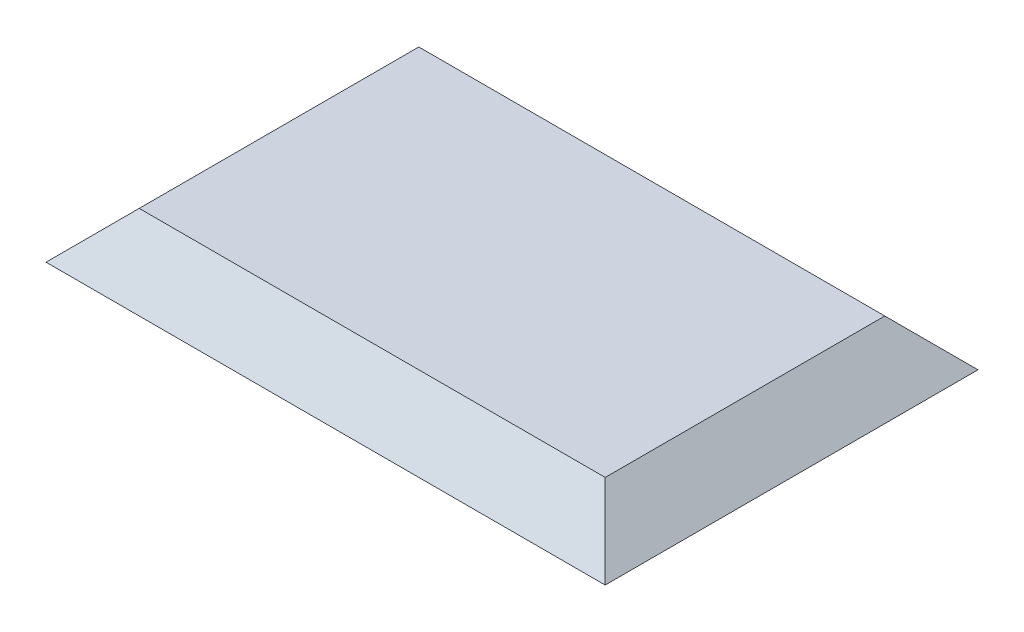
ISO-10303-21;
HEADER;
FILE_DESCRIPTION(('STEP AP214'),'2;1');
FILE_NAME('part.step','',(''),(''),'','','');
FILE_SCHEMA(('AUTOMOTIVE_DESIGN { 1 0 10303 214 1 1 1 1 }'));
ENDSEC;
DATA;
#1=APPLICATION_CONTEXT('core data for automotive mechanical design processes');
#2=APPLICATION_PROTOCOL_DEFINITION('international standard','automotive_design',2000,#1);
#3=PRODUCT_CONTEXT('',#1,'mechanical');
#4=PRODUCT('Part','Part','',(#3));
#5=PRODUCT_RELATED_PRODUCT_CATEGORY('part','',(#4));
#6=PRODUCT_DEFINITION_FORMATION('','',#4);
#7=PRODUCT_DEFINITION_CONTEXT('part definition',#1,'design');
#8=PRODUCT_DEFINITION('design','',#6,#7);
#9=PRODUCT_DEFINITION_SHAPE('','',#8);
#10=(LENGTH_UNIT() NAMED_UNIT(*) SI_UNIT(.MILLI.,.METRE.));
#11=(NAMED_UNIT(*) PLANE_ANGLE_UNIT() SI_UNIT($,.RADIAN.));
#12=(NAMED_UNIT(*) SI_UNIT($,.STERADIAN.) SOLID_ANGLE_UNIT());
#13=UNCERTAINTY_MEASURE_WITH_UNIT(LENGTH_MEASURE(1.E-05),#10,'distance_accuracy_value','');
#14=(GEOMETRIC_REPRESENTATION_CONTEXT(3) GLOBAL_UNCERTAINTY_ASSIGNED_CONTEXT((#13)) GLOBAL_UNIT_ASSIGNED_CONTEXT((#10,
#11,#12)) REPRESENTATION_CONTEXT('',''));
#15=CARTESIAN_POINT('',(0.,0.,0.));
#16=DIRECTION('',(0.,0.,1.));
#17=DIRECTION('',(1.,0.,0.));
#18=AXIS2_PLACEMENT_3D('',#15,#16,#17);
#19=CARTESIAN_POINT('',(0.,0.6,0.));
#20=DIRECTION('',(0.,1.,0.));
#21=DIRECTION('',(0.,0.,1.));
#22=AXIS2_PLACEMENT_3D('',#19,#20,#21);
#23=PLANE('',#22);
#24=DIRECTION('',(0.,0.,-1.));
#25=VECTOR('',#24,1.);
#26=CARTESIAN_POINT('',(1.5,0.6,-1.20000000000001));
#27=LINE('',#26,#25);
#28=CARTESIAN_POINT('',(1.5,0.6,0.899999999999989));
#29=VERTEX_POINT('',#28);
#30=CARTESIAN_POINT('',(1.5,0.6,-0.90000000000001));
#31=VERTEX_POINT('',#30);
#32=EDGE_CURVE('E42',#29,#31,#27,.T.);
#33=ORIENTED_EDGE('',*,*,#32,.T.);
#34=DIRECTION('',(-1.,0.,0.));
#35=VECTOR('',#34,1.);
#36=CARTESIAN_POINT('',(-1.8,0.6,-0.90000000000001));
#37=LINE('',#36,#35);
#38=CARTESIAN_POINT('',(-1.5,0.6,-0.90000000000001));
#39=VERTEX_POINT('',#38);
#40=EDGE_CURVE('E11',#31,#39,#37,.T.);
#41=ORIENTED_EDGE('',*,*,#40,.T.);
#42=DIRECTION('',(0.,0.,1.));
#43=VECTOR('',#42,1.);
#44=CARTESIAN_POINT('',(-1.5,0.6,1.19999999999999));
#45=LINE('',#44,#43);
#46=CARTESIAN_POINT('',(-1.5,0.6,0.899999999999989));
#47=VERTEX_POINT('',#46);
#48=EDGE_CURVE('E92',#39,#47,#45,.T.);
#49=ORIENTED_EDGE('',*,*,#48,.T.);
#50=DIRECTION('',(1.,0.,0.));
#51=VECTOR('',#50,1.);
#52=CARTESIAN_POINT('',(1.8,0.6,0.899999999999989));
#53=LINE('',#52,#51);
#54=EDGE_CURVE('E95',#47,#29,#53,.T.);
#55=ORIENTED_EDGE('',*,*,#54,.T.);
#56=EDGE_LOOP('',(#33,#41,#49,#55));
#57=FACE_BOUND('',#56,.T.);
#58=ADVANCED_FACE('F32',(#57),#23,.T.);
#59=CARTESIAN_POINT('',(0.,0.,0.));
#60=DIRECTION('',(0.,1.,0.));
#61=DIRECTION('',(0.,0.,1.));
#62=AXIS2_PLACEMENT_3D('',#59,#60,#61);
#63=PLANE('',#62);
#64=DIRECTION('',(0.,0.,1.));
#65=VECTOR('',#64,1.);
#66=CARTESIAN_POINT('',(1.5,0.,0.));
#67=LINE('',#66,#65);
#68=CARTESIAN_POINT('',(1.5,0.,-0.900000000000009));
#69=VERTEX_POINT('',#68);
#70=CARTESIAN_POINT('',(1.5,0.,0.899999999999988));
#71=VERTEX_POINT('',#70);
#72=EDGE_CURVE('E139',#69,#71,#67,.T.);
#73=ORIENTED_EDGE('',*,*,#72,.T.);
#74=DIRECTION('',(-1.,0.,0.));
#75=VECTOR('',#74,1.);
#76=CARTESIAN_POINT('',(0.,0.,0.899999999999988));
#77=LINE('',#76,#75);
#78=CARTESIAN_POINT('',(-1.5,0.,0.899999999999988));
#79=VERTEX_POINT('',#78);
#80=EDGE_CURVE('E96',#71,#79,#77,.T.);
#81=ORIENTED_EDGE('',*,*,#80,.T.);
#82=DIRECTION('',(0.,0.,-1.));
#83=VECTOR('',#82,1.);
#84=CARTESIAN_POINT('',(-1.5,0.,0.));
#85=LINE('',#84,#83);
#86=CARTESIAN_POINT('',(-1.5,0.,-0.900000000000009));
#87=VERTEX_POINT('',#86);
#88=EDGE_CURVE('E133',#79,#87,#85,.T.);
#89=ORIENTED_EDGE('',*,*,#88,.T.);
#90=DIRECTION('',(1.,0.,0.));
#91=VECTOR('',#90,1.);
#92=CARTESIAN_POINT('',(0.,0.,-0.900000000000009));
#93=LINE('',#92,#91);
#94=EDGE_CURVE('E134',#87,#69,#93,.T.);
#95=ORIENTED_EDGE('',*,*,#94,.T.);
#96=EDGE_LOOP('',(#73,#81,#89,#95));
#97=FACE_BOUND('',#96,.T.);
#98=ADVANCED_FACE('F142',(#97),#63,.F.);
#99=CARTESIAN_POINT('',(0.,0.6,-0.90000000000001));
#100=DIRECTION('',(0.,0.707106781186546,-0.707106781186549));
#101=DIRECTION('',(1.,0.,0.));
#102=AXIS2_PLACEMENT_3D('',#99,#100,#101);
#103=PLANE('',#102);
#104=DIRECTION('',(-0.577350269189625,-0.577350269189627,-0.577350269189625));
#105=VECTOR('',#104,1.);
#106=CARTESIAN_POINT('',(-1.19999999999999,0.900000000000004,-0.600000000000008));
#107=LINE('',#106,#105);
#108=CARTESIAN_POINT('',(-1.8,0.3,-1.20000000000001));
#109=VERTEX_POINT('',#108);
#110=EDGE_CURVE('E36',#39,#109,#107,.T.);
#111=ORIENTED_EDGE('',*,*,#110,.F.);
#112=ORIENTED_EDGE('',*,*,#40,.F.);
#113=DIRECTION('',(-0.577350269189624,0.577350269189628,0.577350269189625));
#114=VECTOR('',#113,1.);
#115=CARTESIAN_POINT('',(1.2,0.900000000000003,-0.600000000000009));
#116=LINE('',#115,#114);
#117=CARTESIAN_POINT('',(1.8,0.3,-1.20000000000001));
#118=VERTEX_POINT('',#117);
#119=EDGE_CURVE('E65',#118,#31,#116,.T.);
#120=ORIENTED_EDGE('',*,*,#119,.F.);
#121=DIRECTION('',(1.,0.,0.));
#122=VECTOR('',#121,1.);
#123=CARTESIAN_POINT('',(1.8,0.299999999999999,-1.20000000000001));
#124=LINE('',#123,#122);
#125=EDGE_CURVE('E130',#109,#118,#124,.T.);
#126=ORIENTED_EDGE('',*,*,#125,.F.);
#127=EDGE_LOOP('',(#111,#112,#120,#126));
#128=FACE_BOUND('',#127,.T.);
#129=ADVANCED_FACE('F34',(#128),#103,.T.);
#130=CARTESIAN_POINT('',(-1.5,0.6,0.));
#131=DIRECTION('',(-0.707106781186549,0.707106781186546,0.));
#132=DIRECTION('',(0.,0.,-1.));
#133=AXIS2_PLACEMENT_3D('',#130,#131,#132);
#134=PLANE('',#133);
#135=ORIENTED_EDGE('',*,*,#48,.F.);
#136=ORIENTED_EDGE('',*,*,#110,.T.);
#137=DIRECTION('',(0.,0.,-1.));
#138=VECTOR('',#137,1.);
#139=CARTESIAN_POINT('',(-1.8,0.299999999999999,-1.20000000000001));
#140=LINE('',#139,#138);
#141=CARTESIAN_POINT('',(-1.8,0.3,1.19999999999999));
#142=VERTEX_POINT('',#141);
#143=EDGE_CURVE('E102',#142,#109,#140,.T.);
#144=ORIENTED_EDGE('',*,*,#143,.F.);
#145=DIRECTION('',(0.577350269189625,0.577350269189627,-0.577350269189625));
#146=VECTOR('',#145,1.);
#147=CARTESIAN_POINT('',(-1.2,0.899999999999997,0.599999999999994));
#148=LINE('',#147,#146);
#149=EDGE_CURVE('E99',#47,#142,#148,.F.);
#150=ORIENTED_EDGE('',*,*,#149,.F.);
#151=EDGE_LOOP('',(#135,#136,#144,#150));
#152=FACE_BOUND('',#151,.T.);
#153=ADVANCED_FACE('F100',(#152),#134,.T.);
#154=CARTESIAN_POINT('',(1.5,0.6,0.));
#155=DIRECTION('',(0.707106781186549,0.707106781186546,0.));
#156=DIRECTION('',(0.,0.,1.));
#157=AXIS2_PLACEMENT_3D('',#154,#155,#156);
#158=PLANE('',#157);
#159=ORIENTED_EDGE('',*,*,#119,.T.);
#160=ORIENTED_EDGE('',*,*,#32,.F.);
#161=DIRECTION('',(-0.577350269189626,0.577350269189627,-0.577350269189625));
#162=VECTOR('',#161,1.);
#163=CARTESIAN_POINT('',(1.,1.1,0.399999999999991));
#164=LINE('',#163,#162);
#165=CARTESIAN_POINT('',(1.8,0.3,1.19999999999999));
#166=VERTEX_POINT('',#165);
#167=EDGE_CURVE('E105',#166,#29,#164,.T.);
#168=ORIENTED_EDGE('',*,*,#167,.F.);
#169=DIRECTION('',(0.,0.,1.));
#170=VECTOR('',#169,1.);
#171=CARTESIAN_POINT('',(1.8,0.299999999999999,1.19999999999999));
#172=LINE('',#171,#170);
#173=EDGE_CURVE('E122',#118,#166,#172,.T.);
#174=ORIENTED_EDGE('',*,*,#173,.F.);
#175=EDGE_LOOP('',(#159,#160,#168,#174));
#176=FACE_BOUND('',#175,.T.);
#177=ADVANCED_FACE('F149',(#176),#158,.T.);
#178=CARTESIAN_POINT('',(1.8,0.3,-1.20000000000001));
#179=DIRECTION('',(0.,0.707106781186549,0.707106781186547));
#180=DIRECTION('',(-1.,0.,0.));
#181=AXIS2_PLACEMENT_3D('',#178,#179,#180);
#182=PLANE('',#181);
#183=DIRECTION('',(-0.577350269189626,-0.577350269189625,0.577350269189627));
#184=VECTOR('',#183,1.);
#185=CARTESIAN_POINT('',(1.8,0.3,-1.20000000000001));
#186=LINE('',#185,#184);
#187=EDGE_CURVE('E119',#69,#118,#186,.F.);
#188=ORIENTED_EDGE('',*,*,#187,.F.);
#189=ORIENTED_EDGE('',*,*,#94,.F.);
#190=DIRECTION('',(0.577350269189626,-0.577350269189625,0.577350269189626));
#191=VECTOR('',#190,1.);
#192=CARTESIAN_POINT('',(-0.999999999999995,-0.499999999999999,-0.400000000000009));
#193=LINE('',#192,#191);
#194=EDGE_CURVE('E127',#109,#87,#193,.T.);
#195=ORIENTED_EDGE('',*,*,#194,.F.);
#196=ORIENTED_EDGE('',*,*,#125,.T.);
#197=EDGE_LOOP('',(#188,#189,#195,#196));
#198=FACE_BOUND('',#197,.T.);
#199=ADVANCED_FACE('F151',(#198),#182,.F.);
#200=CARTESIAN_POINT('',(-1.8,0.3,1.19999999999999));
#201=DIRECTION('',(0.707106781186547,0.707106781186549,0.));
#202=DIRECTION('',(0.,0.,1.));
#203=AXIS2_PLACEMENT_3D('',#200,#201,#202);
#204=PLANE('',#203);
#205=ORIENTED_EDGE('',*,*,#194,.T.);
#206=ORIENTED_EDGE('',*,*,#88,.F.);
#207=DIRECTION('',(-0.577350269189626,0.577350269189625,0.577350269189626));
#208=VECTOR('',#207,1.);
#209=CARTESIAN_POINT('',(-1.8,0.3,1.19999999999999));
#210=LINE('',#209,#208);
#211=EDGE_CURVE('E79',#142,#79,#210,.F.);
#212=ORIENTED_EDGE('',*,*,#211,.F.);
#213=ORIENTED_EDGE('',*,*,#143,.T.);
#214=EDGE_LOOP('',(#205,#206,#212,#213));
#215=FACE_BOUND('',#214,.T.);
#216=ADVANCED_FACE('F157',(#215),#204,.F.);
#217=CARTESIAN_POINT('',(0.,0.6,0.899999999999989));
#218=DIRECTION('',(0.,0.707106781186546,0.707106781186549));
#219=DIRECTION('',(-1.,0.,0.));
#220=AXIS2_PLACEMENT_3D('',#217,#218,#219);
#221=PLANE('',#220);
#222=ORIENTED_EDGE('',*,*,#54,.F.);
#223=ORIENTED_EDGE('',*,*,#149,.T.);
#224=DIRECTION('',(-1.,0.,0.));
#225=VECTOR('',#224,1.);
#226=CARTESIAN_POINT('',(-1.8,0.299999999999999,1.19999999999999));
#227=LINE('',#226,#225);
#228=EDGE_CURVE('E116',#166,#142,#227,.T.);
#229=ORIENTED_EDGE('',*,*,#228,.F.);
#230=ORIENTED_EDGE('',*,*,#167,.T.);
#231=EDGE_LOOP('',(#222,#223,#229,#230));
#232=FACE_BOUND('',#231,.T.);
#233=ADVANCED_FACE('F108',(#232),#221,.T.);
#234=CARTESIAN_POINT('',(1.8,0.3,1.19999999999999));
#235=DIRECTION('',(-0.707106781186547,0.707106781186549,0.));
#236=DIRECTION('',(0.,0.,-1.));
#237=AXIS2_PLACEMENT_3D('',#234,#235,#236);
#238=PLANE('',#237);
#239=ORIENTED_EDGE('',*,*,#187,.T.);
#240=ORIENTED_EDGE('',*,*,#173,.T.);
#241=DIRECTION('',(-0.577350269189627,-0.577350269189624,-0.577350269189626));
#242=VECTOR('',#241,1.);
#243=CARTESIAN_POINT('',(1.8,0.3,1.19999999999999));
#244=LINE('',#243,#242);
#245=EDGE_CURVE('E113',#71,#166,#244,.F.);
#246=ORIENTED_EDGE('',*,*,#245,.F.);
#247=ORIENTED_EDGE('',*,*,#72,.F.);
#248=EDGE_LOOP('',(#239,#240,#246,#247));
#249=FACE_BOUND('',#248,.T.);
#250=ADVANCED_FACE('F147',(#249),#238,.F.);
#251=CARTESIAN_POINT('',(1.8,0.3,1.19999999999999));
#252=DIRECTION('',(0.,0.707106781186549,-0.707106781186547));
#253=DIRECTION('',(1.,0.,0.));
#254=AXIS2_PLACEMENT_3D('',#251,#252,#253);
#255=PLANE('',#254);
#256=ORIENTED_EDGE('',*,*,#211,.T.);
#257=ORIENTED_EDGE('',*,*,#80,.F.);
#258=ORIENTED_EDGE('',*,*,#245,.T.);
#259=ORIENTED_EDGE('',*,*,#228,.T.);
#260=EDGE_LOOP('',(#256,#257,#258,#259));
#261=FACE_BOUND('',#260,.T.);
#262=ADVANCED_FACE('F145',(#261),#255,.F.);
#263=CLOSED_SHELL('',(#58,#98,#129,#153,#177,#199,#216,#233,#250,#262));
#264=MANIFOLD_SOLID_BREP('B2',#263);
#265=ADVANCED_BREP_SHAPE_REPRESENTATION('',(#18,#264),#14);
#266=SHAPE_DEFINITION_REPRESENTATION(#9,#265);
ENDSEC;
END-ISO-10303-21;
